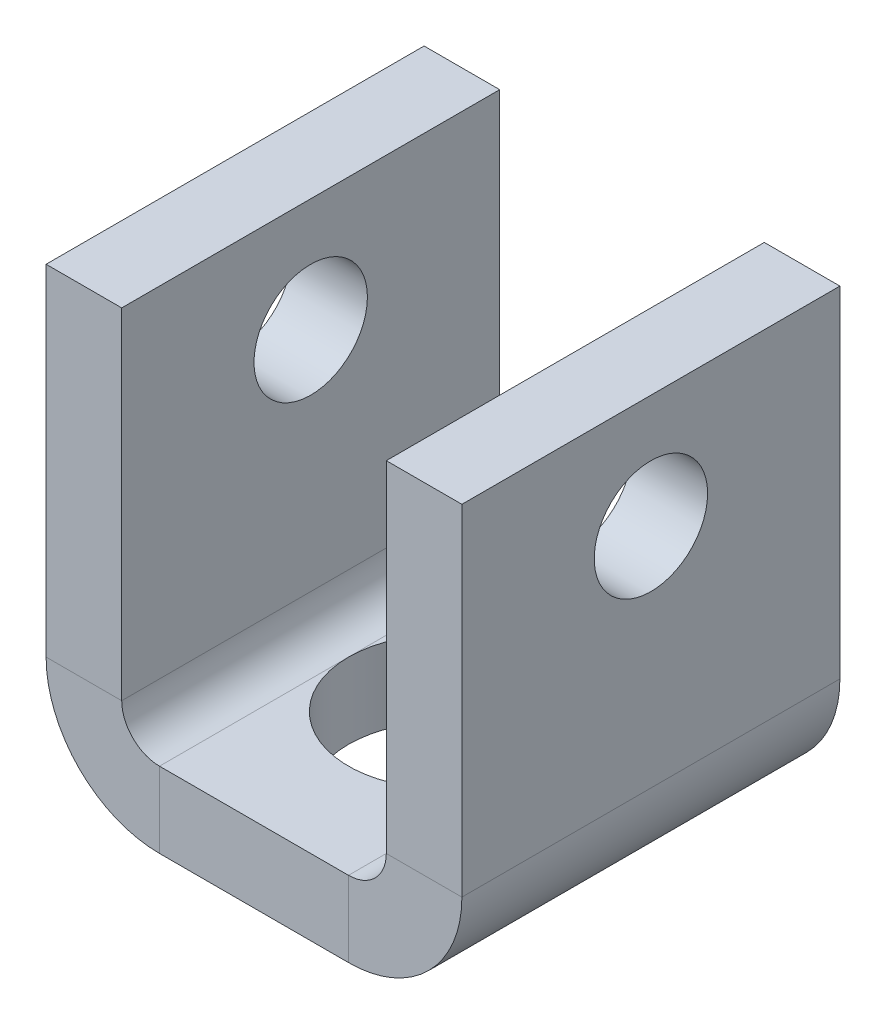
ISO-10303-21;
HEADER;
FILE_DESCRIPTION(('STEP AP214'),'2;1');
FILE_NAME('part.step','',(''),(''),'','','');
FILE_SCHEMA(('AUTOMOTIVE_DESIGN { 1 0 10303 214 1 1 1 1 }'));
ENDSEC;
DATA;
#1=APPLICATION_CONTEXT('core data for automotive mechanical design processes');
#2=APPLICATION_PROTOCOL_DEFINITION('international standard','automotive_design',2000,#1);
#3=PRODUCT_CONTEXT('',#1,'mechanical');
#4=PRODUCT('Part','Part','',(#3));
#5=PRODUCT_RELATED_PRODUCT_CATEGORY('part','',(#4));
#6=PRODUCT_DEFINITION_FORMATION('','',#4);
#7=PRODUCT_DEFINITION_CONTEXT('part definition',#1,'design');
#8=PRODUCT_DEFINITION('design','',#6,#7);
#9=PRODUCT_DEFINITION_SHAPE('','',#8);
#10=(LENGTH_UNIT() NAMED_UNIT(*) SI_UNIT(.MILLI.,.METRE.));
#11=(NAMED_UNIT(*) PLANE_ANGLE_UNIT() SI_UNIT($,.RADIAN.));
#12=(NAMED_UNIT(*) SI_UNIT($,.STERADIAN.) SOLID_ANGLE_UNIT());
#13=UNCERTAINTY_MEASURE_WITH_UNIT(LENGTH_MEASURE(1.E-05),#10,'distance_accuracy_value','');
#14=(GEOMETRIC_REPRESENTATION_CONTEXT(3) GLOBAL_UNCERTAINTY_ASSIGNED_CONTEXT((#13)) GLOBAL_UNIT_ASSIGNED_CONTEXT((#10,
#11,#12)) REPRESENTATION_CONTEXT('',''));
#15=CARTESIAN_POINT('',(0.,0.,0.));
#16=DIRECTION('',(0.,0.,1.));
#17=DIRECTION('',(1.,0.,0.));
#18=AXIS2_PLACEMENT_3D('',#15,#16,#17);
#19=CARTESIAN_POINT('',(-45.2821772639692,22.8679913294798,10.));
#20=DIRECTION('',(0.,1.,0.));
#21=DIRECTION('',(0.,0.,1.));
#22=AXIS2_PLACEMENT_3D('',#19,#20,#21);
#23=PLANE('',#22);
#24=DIRECTION('',(0.,0.,1.));
#25=VECTOR('',#24,1.);
#26=CARTESIAN_POINT('',(-42.2821772639692,22.8679913294798,0.));
#27=LINE('',#26,#25);
#28=CARTESIAN_POINT('',(-42.2821772639692,22.8679913294798,0.));
#29=VERTEX_POINT('',#28);
#30=CARTESIAN_POINT('',(-42.2821772639692,22.8679913294798,5.));
#31=VERTEX_POINT('',#30);
#32=EDGE_CURVE('E150',#29,#31,#27,.T.);
#33=ORIENTED_EDGE('',*,*,#32,.T.);
#34=CARTESIAN_POINT('',(-39.7821772639692,22.8679913294798,5.));
#35=DIRECTION('',(0.,1.,0.));
#36=DIRECTION('',(0.,0.,1.));
#37=AXIS2_PLACEMENT_3D('',#34,#35,#36);
#38=CIRCLE('',#37,2.5);
#39=CARTESIAN_POINT('',(-37.2821772639692,22.8679913294798,5.));
#40=VERTEX_POINT('',#39);
#41=EDGE_CURVE('E59',#31,#40,#38,.F.);
#42=ORIENTED_EDGE('',*,*,#41,.T.);
#43=DIRECTION('',(0.,0.,-1.));
#44=VECTOR('',#43,1.);
#45=CARTESIAN_POINT('',(-37.2821772639692,22.8679913294798,10.));
#46=LINE('',#45,#44);
#47=CARTESIAN_POINT('',(-37.2821772639692,22.8679913294798,0.));
#48=VERTEX_POINT('',#47);
#49=EDGE_CURVE('E147',#40,#48,#46,.T.);
#50=ORIENTED_EDGE('',*,*,#49,.T.);
#51=DIRECTION('',(1.,0.,0.));
#52=VECTOR('',#51,1.);
#53=CARTESIAN_POINT('',(-45.2821772639692,22.8679913294798,0.));
#54=LINE('',#53,#52);
#55=EDGE_CURVE('E302',#29,#48,#54,.T.);
#56=ORIENTED_EDGE('',*,*,#55,.F.);
#57=EDGE_LOOP('',(#33,#42,#50,#56));
#58=FACE_BOUND('',#57,.T.);
#59=ADVANCED_FACE('F36',(#58),#23,.T.);
#60=CARTESIAN_POINT('',(-37.2821772639692,22.8679913294798,10.));
#61=VERTEX_POINT('',#60);
#62=EDGE_CURVE('E159',#61,#40,#46,.T.);
#63=ORIENTED_EDGE('',*,*,#62,.T.);
#64=CARTESIAN_POINT('',(-39.7821772639692,22.8679913294798,5.));
#65=DIRECTION('',(0.,1.,0.));
#66=DIRECTION('',(0.,0.,1.));
#67=AXIS2_PLACEMENT_3D('',#64,#65,#66);
#68=CIRCLE('',#67,2.5);
#69=EDGE_CURVE('E136',#40,#31,#68,.F.);
#70=ORIENTED_EDGE('',*,*,#69,.T.);
#71=CARTESIAN_POINT('',(-42.2821772639692,22.8679913294798,10.));
#72=VERTEX_POINT('',#71);
#73=EDGE_CURVE('E305',#31,#72,#27,.T.);
#74=ORIENTED_EDGE('',*,*,#73,.T.);
#75=DIRECTION('',(1.,0.,0.));
#76=VECTOR('',#75,1.);
#77=CARTESIAN_POINT('',(-45.2821772639692,22.8679913294798,10.));
#78=LINE('',#77,#76);
#79=EDGE_CURVE('E169',#72,#61,#78,.T.);
#80=ORIENTED_EDGE('',*,*,#79,.T.);
#81=EDGE_LOOP('',(#63,#70,#74,#80));
#82=FACE_BOUND('',#81,.T.);
#83=ADVANCED_FACE('F167',(#82),#23,.T.);
#84=CARTESIAN_POINT('',(-45.2821772639692,20.8679913294798,10.));
#85=DIRECTION('',(0.,1.,0.));
#86=DIRECTION('',(0.,0.,1.));
#87=AXIS2_PLACEMENT_3D('',#84,#85,#86);
#88=PLANE('',#87);
#89=CARTESIAN_POINT('',(-39.7821772639692,20.8679913294798,5.));
#90=DIRECTION('',(0.,1.,0.));
#91=DIRECTION('',(0.,0.,1.));
#92=AXIS2_PLACEMENT_3D('',#89,#90,#91);
#93=CIRCLE('',#92,2.5);
#94=CARTESIAN_POINT('',(-42.2821772639692,20.8679913294798,5.));
#95=VERTEX_POINT('',#94);
#96=CARTESIAN_POINT('',(-37.2821772639692,20.8679913294798,5.));
#97=VERTEX_POINT('',#96);
#98=EDGE_CURVE('E52',#95,#97,#93,.F.);
#99=ORIENTED_EDGE('',*,*,#98,.F.);
#100=DIRECTION('',(0.,0.,1.));
#101=VECTOR('',#100,1.);
#102=CARTESIAN_POINT('',(-42.2821772639692,20.8679913294798,0.));
#103=LINE('',#102,#101);
#104=CARTESIAN_POINT('',(-42.2821772639692,20.8679913294798,0.));
#105=VERTEX_POINT('',#104);
#106=EDGE_CURVE('E300',#105,#95,#103,.T.);
#107=ORIENTED_EDGE('',*,*,#106,.F.);
#108=DIRECTION('',(1.,0.,0.));
#109=VECTOR('',#108,1.);
#110=CARTESIAN_POINT('',(-45.2821772639692,20.8679913294798,0.));
#111=LINE('',#110,#109);
#112=CARTESIAN_POINT('',(-37.2821772639692,20.8679913294798,0.));
#113=VERTEX_POINT('',#112);
#114=EDGE_CURVE('E290',#105,#113,#111,.T.);
#115=ORIENTED_EDGE('',*,*,#114,.T.);
#116=DIRECTION('',(0.,0.,-1.));
#117=VECTOR('',#116,1.);
#118=CARTESIAN_POINT('',(-37.2821772639692,20.8679913294798,10.));
#119=LINE('',#118,#117);
#120=EDGE_CURVE('E170',#97,#113,#119,.T.);
#121=ORIENTED_EDGE('',*,*,#120,.F.);
#122=EDGE_LOOP('',(#99,#107,#115,#121));
#123=FACE_BOUND('',#122,.T.);
#124=ADVANCED_FACE('F325',(#123),#88,.F.);
#125=EDGE_CURVE('E152',#97,#95,#93,.F.);
#126=ORIENTED_EDGE('',*,*,#125,.F.);
#127=CARTESIAN_POINT('',(-37.2821772639692,20.8679913294798,10.));
#128=VERTEX_POINT('',#127);
#129=EDGE_CURVE('E171',#128,#97,#119,.T.);
#130=ORIENTED_EDGE('',*,*,#129,.F.);
#131=DIRECTION('',(1.,0.,0.));
#132=VECTOR('',#131,1.);
#133=CARTESIAN_POINT('',(-45.2821772639692,20.8679913294798,10.));
#134=LINE('',#133,#132);
#135=CARTESIAN_POINT('',(-42.2821772639692,20.8679913294798,10.));
#136=VERTEX_POINT('',#135);
#137=EDGE_CURVE('E295',#136,#128,#134,.T.);
#138=ORIENTED_EDGE('',*,*,#137,.F.);
#139=EDGE_CURVE('E299',#95,#136,#103,.T.);
#140=ORIENTED_EDGE('',*,*,#139,.F.);
#141=EDGE_LOOP('',(#126,#130,#138,#140));
#142=FACE_BOUND('',#141,.T.);
#143=ADVANCED_FACE('F321',(#142),#88,.F.);
#144=CARTESIAN_POINT('',(-16.3749291698218,32.8679913294798,10.));
#145=DIRECTION('',(0.,1.,0.));
#146=DIRECTION('',(-1.,0.,0.));
#147=AXIS2_PLACEMENT_3D('',#144,#145,#146);
#148=PLANE('',#147);
#149=DIRECTION('',(0.,0.,-1.));
#150=VECTOR('',#149,1.);
#151=CARTESIAN_POINT('',(-45.2821772639692,32.8679913294798,10.));
#152=LINE('',#151,#150);
#153=CARTESIAN_POINT('',(-45.2821772639692,32.8679913294798,10.));
#154=VERTEX_POINT('',#153);
#155=CARTESIAN_POINT('',(-45.2821772639692,32.8679913294798,0.));
#156=VERTEX_POINT('',#155);
#157=EDGE_CURVE('E216',#154,#156,#152,.T.);
#158=ORIENTED_EDGE('',*,*,#157,.F.);
#159=DIRECTION('',(-1.,0.,0.));
#160=VECTOR('',#159,1.);
#161=CARTESIAN_POINT('',(-16.3749291698218,32.8679913294798,10.));
#162=LINE('',#161,#160);
#163=CARTESIAN_POINT('',(-43.2821772639692,32.8679913294798,10.));
#164=VERTEX_POINT('',#163);
#165=EDGE_CURVE('E213',#164,#154,#162,.T.);
#166=ORIENTED_EDGE('',*,*,#165,.F.);
#167=DIRECTION('',(0.,0.,-1.));
#168=VECTOR('',#167,1.);
#169=CARTESIAN_POINT('',(-43.2821772639692,32.8679913294798,10.));
#170=LINE('',#169,#168);
#171=CARTESIAN_POINT('',(-43.2821772639692,32.8679913294798,0.));
#172=VERTEX_POINT('',#171);
#173=EDGE_CURVE('E234',#164,#172,#170,.T.);
#174=ORIENTED_EDGE('',*,*,#173,.T.);
#175=DIRECTION('',(-1.,0.,0.));
#176=VECTOR('',#175,1.);
#177=CARTESIAN_POINT('',(-16.3749291698218,32.8679913294798,0.));
#178=LINE('',#177,#176);
#179=EDGE_CURVE('E231',#172,#156,#178,.T.);
#180=ORIENTED_EDGE('',*,*,#179,.T.);
#181=EDGE_LOOP('',(#158,#166,#174,#180));
#182=FACE_BOUND('',#181,.T.);
#183=ADVANCED_FACE('F263',(#182),#148,.T.);
#184=CARTESIAN_POINT('',(-16.3749291698218,32.8679913294798,0.));
#185=DIRECTION('',(0.,0.,-1.));
#186=DIRECTION('',(0.,1.,0.));
#187=AXIS2_PLACEMENT_3D('',#184,#185,#186);
#188=PLANE('',#187);
#189=DIRECTION('',(0.,-1.,0.));
#190=VECTOR('',#189,1.);
#191=CARTESIAN_POINT('',(-45.2821772639692,32.8679913294798,0.));
#192=LINE('',#191,#190);
#193=CARTESIAN_POINT('',(-45.2821772639692,23.8679913294798,0.));
#194=VERTEX_POINT('',#193);
#195=EDGE_CURVE('E221',#156,#194,#192,.T.);
#196=ORIENTED_EDGE('',*,*,#195,.F.);
#197=ORIENTED_EDGE('',*,*,#179,.F.);
#198=DIRECTION('',(0.,1.,0.));
#199=VECTOR('',#198,1.);
#200=CARTESIAN_POINT('',(-43.2821772639692,32.8679913294798,0.));
#201=LINE('',#200,#199);
#202=CARTESIAN_POINT('',(-43.2821772639692,23.8679913294798,0.));
#203=VERTEX_POINT('',#202);
#204=EDGE_CURVE('E228',#172,#203,#201,.F.);
#205=ORIENTED_EDGE('',*,*,#204,.T.);
#206=DIRECTION('',(-1.,0.,0.));
#207=VECTOR('',#206,1.);
#208=CARTESIAN_POINT('',(-16.3749291698218,23.8679913294798,0.));
#209=LINE('',#208,#207);
#210=EDGE_CURVE('E225',#203,#194,#209,.T.);
#211=ORIENTED_EDGE('',*,*,#210,.T.);
#212=EDGE_LOOP('',(#196,#197,#205,#211));
#213=FACE_BOUND('',#212,.T.);
#214=ADVANCED_FACE('F266',(#213),#188,.T.);
#215=CARTESIAN_POINT('',(-45.2821772639692,32.8679913294798,10.));
#216=DIRECTION('',(1.,0.,0.));
#217=DIRECTION('',(0.,0.,-1.));
#218=AXIS2_PLACEMENT_3D('',#215,#216,#217);
#219=PLANE('',#218);
#220=CARTESIAN_POINT('',(-45.2821772639692,29.8679913294798,5.));
#221=DIRECTION('',(1.,0.,0.));
#222=DIRECTION('',(0.,0.,-1.));
#223=AXIS2_PLACEMENT_3D('',#220,#221,#222);
#224=CIRCLE('',#223,1.5);
#225=CARTESIAN_POINT('',(-45.2821772639692,29.8679913294798,3.5));
#226=VERTEX_POINT('',#225);
#227=EDGE_CURVE('E386',#226,#226,#224,.F.);
#228=ORIENTED_EDGE('',*,*,#227,.F.);
#229=EDGE_LOOP('',(#228));
#230=FACE_BOUND('',#229,.T.);
#231=ORIENTED_EDGE('',*,*,#195,.T.);
#232=DIRECTION('',(0.,0.,1.));
#233=VECTOR('',#232,1.);
#234=CARTESIAN_POINT('',(-45.2821772639692,23.8679913294798,0.));
#235=LINE('',#234,#233);
#236=CARTESIAN_POINT('',(-45.2821772639692,23.8679913294798,10.));
#237=VERTEX_POINT('',#236);
#238=EDGE_CURVE('E218',#194,#237,#235,.T.);
#239=ORIENTED_EDGE('',*,*,#238,.T.);
#240=DIRECTION('',(0.,-1.,0.));
#241=VECTOR('',#240,1.);
#242=CARTESIAN_POINT('',(-45.2821772639692,32.8679913294798,10.));
#243=LINE('',#242,#241);
#244=EDGE_CURVE('E45',#154,#237,#243,.T.);
#245=ORIENTED_EDGE('',*,*,#244,.F.);
#246=ORIENTED_EDGE('',*,*,#157,.T.);
#247=EDGE_LOOP('',(#231,#239,#245,#246));
#248=FACE_BOUND('',#247,.T.);
#249=ADVANCED_FACE('F268',(#230,#248),#219,.F.);
#250=CARTESIAN_POINT('',(-16.3749291698218,32.8679913294798,10.));
#251=DIRECTION('',(0.,0.,-1.));
#252=DIRECTION('',(0.,1.,0.));
#253=AXIS2_PLACEMENT_3D('',#250,#251,#252);
#254=PLANE('',#253);
#255=ORIENTED_EDGE('',*,*,#165,.T.);
#256=ORIENTED_EDGE('',*,*,#244,.T.);
#257=DIRECTION('',(-1.,0.,0.));
#258=VECTOR('',#257,1.);
#259=CARTESIAN_POINT('',(-16.3749291698218,23.8679913294798,10.));
#260=LINE('',#259,#258);
#261=CARTESIAN_POINT('',(-43.2821772639692,23.8679913294798,10.));
#262=VERTEX_POINT('',#261);
#263=EDGE_CURVE('E236',#262,#237,#260,.T.);
#264=ORIENTED_EDGE('',*,*,#263,.F.);
#265=DIRECTION('',(0.,1.,0.));
#266=VECTOR('',#265,1.);
#267=CARTESIAN_POINT('',(-43.2821772639692,32.8679913294798,10.));
#268=LINE('',#267,#266);
#269=EDGE_CURVE('E11',#164,#262,#268,.F.);
#270=ORIENTED_EDGE('',*,*,#269,.F.);
#271=EDGE_LOOP('',(#255,#256,#264,#270));
#272=FACE_BOUND('',#271,.T.);
#273=ADVANCED_FACE('F257',(#272),#254,.F.);
#274=CARTESIAN_POINT('',(-43.2821772639692,32.8679913294798,10.));
#275=DIRECTION('',(1.,0.,0.));
#276=DIRECTION('',(0.,0.,-1.));
#277=AXIS2_PLACEMENT_3D('',#274,#275,#276);
#278=PLANE('',#277);
#279=CARTESIAN_POINT('',(-43.2821772639692,29.8679913294798,5.));
#280=DIRECTION('',(1.,0.,0.));
#281=DIRECTION('',(0.,0.,-1.));
#282=AXIS2_PLACEMENT_3D('',#279,#280,#281);
#283=CIRCLE('',#282,1.5);
#284=CARTESIAN_POINT('',(-43.2821772639692,29.8679913294798,3.5));
#285=VERTEX_POINT('',#284);
#286=EDGE_CURVE('E394',#285,#285,#283,.T.);
#287=ORIENTED_EDGE('',*,*,#286,.F.);
#288=EDGE_LOOP('',(#287));
#289=FACE_BOUND('',#288,.T.);
#290=DIRECTION('',(0.,0.,1.));
#291=VECTOR('',#290,1.);
#292=CARTESIAN_POINT('',(-43.2821772639692,23.8679913294798,0.));
#293=LINE('',#292,#291);
#294=EDGE_CURVE('E180',#203,#262,#293,.T.);
#295=ORIENTED_EDGE('',*,*,#294,.F.);
#296=ORIENTED_EDGE('',*,*,#204,.F.);
#297=ORIENTED_EDGE('',*,*,#173,.F.);
#298=ORIENTED_EDGE('',*,*,#269,.T.);
#299=EDGE_LOOP('',(#295,#296,#297,#298));
#300=FACE_BOUND('',#299,.T.);
#301=ADVANCED_FACE('F38',(#289,#300),#278,.T.);
#302=CARTESIAN_POINT('',(-63.1894253581166,32.8679913294798,10.));
#303=DIRECTION('',(0.,-1.,0.));
#304=DIRECTION('',(1.,0.,0.));
#305=AXIS2_PLACEMENT_3D('',#302,#303,#304);
#306=PLANE('',#305);
#307=DIRECTION('',(1.,0.,0.));
#308=VECTOR('',#307,1.);
#309=CARTESIAN_POINT('',(-63.1894253581166,32.8679913294798,10.));
#310=LINE('',#309,#308);
#311=CARTESIAN_POINT('',(-36.2821772639692,32.8679913294798,10.));
#312=VERTEX_POINT('',#311);
#313=CARTESIAN_POINT('',(-34.2821772639692,32.8679913294798,10.));
#314=VERTEX_POINT('',#313);
#315=EDGE_CURVE('E203',#312,#314,#310,.T.);
#316=ORIENTED_EDGE('',*,*,#315,.T.);
#317=DIRECTION('',(0.,0.,-1.));
#318=VECTOR('',#317,1.);
#319=CARTESIAN_POINT('',(-34.2821772639692,32.8679913294798,10.));
#320=LINE('',#319,#318);
#321=CARTESIAN_POINT('',(-34.2821772639692,32.8679913294798,0.));
#322=VERTEX_POINT('',#321);
#323=EDGE_CURVE('E199',#314,#322,#320,.T.);
#324=ORIENTED_EDGE('',*,*,#323,.T.);
#325=DIRECTION('',(1.,0.,0.));
#326=VECTOR('',#325,1.);
#327=CARTESIAN_POINT('',(-63.1894253581166,32.8679913294798,0.));
#328=LINE('',#327,#326);
#329=CARTESIAN_POINT('',(-36.2821772639692,32.8679913294798,0.));
#330=VERTEX_POINT('',#329);
#331=EDGE_CURVE('E183',#330,#322,#328,.T.);
#332=ORIENTED_EDGE('',*,*,#331,.F.);
#333=DIRECTION('',(0.,0.,-1.));
#334=VECTOR('',#333,1.);
#335=CARTESIAN_POINT('',(-36.2821772639692,32.8679913294798,10.));
#336=LINE('',#335,#334);
#337=EDGE_CURVE('E178',#312,#330,#336,.T.);
#338=ORIENTED_EDGE('',*,*,#337,.F.);
#339=EDGE_LOOP('',(#316,#324,#332,#338));
#340=FACE_BOUND('',#339,.T.);
#341=ADVANCED_FACE('F342',(#340),#306,.F.);
#342=CARTESIAN_POINT('',(-63.1894253581166,20.8679913294798,10.));
#343=DIRECTION('',(0.,0.,-1.));
#344=DIRECTION('',(0.,-1.,0.));
#345=AXIS2_PLACEMENT_3D('',#342,#343,#344);
#346=PLANE('',#345);
#347=DIRECTION('',(1.,0.,0.));
#348=VECTOR('',#347,1.);
#349=CARTESIAN_POINT('',(-63.1894253581166,23.8679913294798,10.));
#350=LINE('',#349,#348);
#351=CARTESIAN_POINT('',(-36.2821772639692,23.8679913294798,10.));
#352=VERTEX_POINT('',#351);
#353=CARTESIAN_POINT('',(-34.2821772639692,23.8679913294798,10.));
#354=VERTEX_POINT('',#353);
#355=EDGE_CURVE('E196',#352,#354,#350,.T.);
#356=ORIENTED_EDGE('',*,*,#355,.T.);
#357=DIRECTION('',(0.,1.,0.));
#358=VECTOR('',#357,1.);
#359=CARTESIAN_POINT('',(-34.2821772639692,20.8679913294798,10.));
#360=LINE('',#359,#358);
#361=EDGE_CURVE('E194',#354,#314,#360,.T.);
#362=ORIENTED_EDGE('',*,*,#361,.T.);
#363=ORIENTED_EDGE('',*,*,#315,.F.);
#364=DIRECTION('',(0.,1.,0.));
#365=VECTOR('',#364,1.);
#366=CARTESIAN_POINT('',(-36.2821772639692,20.8679913294798,10.));
#367=LINE('',#366,#365);
#368=EDGE_CURVE('E181',#352,#312,#367,.T.);
#369=ORIENTED_EDGE('',*,*,#368,.F.);
#370=EDGE_LOOP('',(#356,#362,#363,#369));
#371=FACE_BOUND('',#370,.T.);
#372=ADVANCED_FACE('F346',(#371),#346,.F.);
#373=CARTESIAN_POINT('',(-34.2821772639692,20.8679913294798,10.));
#374=DIRECTION('',(-1.,0.,0.));
#375=DIRECTION('',(0.,0.,1.));
#376=AXIS2_PLACEMENT_3D('',#373,#374,#375);
#377=PLANE('',#376);
#378=CARTESIAN_POINT('',(-34.2821772639692,29.8679913294798,5.));
#379=DIRECTION('',(1.,0.,0.));
#380=DIRECTION('',(0.,0.,-1.));
#381=AXIS2_PLACEMENT_3D('',#378,#379,#380);
#382=CIRCLE('',#381,1.5);
#383=CARTESIAN_POINT('',(-34.2821772639692,29.8679913294798,3.5));
#384=VERTEX_POINT('',#383);
#385=EDGE_CURVE('E383',#384,#384,#382,.T.);
#386=ORIENTED_EDGE('',*,*,#385,.F.);
#387=EDGE_LOOP('',(#386));
#388=FACE_BOUND('',#387,.T.);
#389=ORIENTED_EDGE('',*,*,#361,.F.);
#390=DIRECTION('',(0.,0.,-1.));
#391=VECTOR('',#390,1.);
#392=CARTESIAN_POINT('',(-34.2821772639692,23.8679913294798,10.));
#393=LINE('',#392,#391);
#394=CARTESIAN_POINT('',(-34.2821772639692,23.8679913294798,0.));
#395=VERTEX_POINT('',#394);
#396=EDGE_CURVE('E191',#354,#395,#393,.T.);
#397=ORIENTED_EDGE('',*,*,#396,.T.);
#398=DIRECTION('',(0.,1.,0.));
#399=VECTOR('',#398,1.);
#400=CARTESIAN_POINT('',(-34.2821772639692,20.8679913294798,0.));
#401=LINE('',#400,#399);
#402=EDGE_CURVE('E188',#395,#322,#401,.T.);
#403=ORIENTED_EDGE('',*,*,#402,.T.);
#404=ORIENTED_EDGE('',*,*,#323,.F.);
#405=EDGE_LOOP('',(#389,#397,#403,#404));
#406=FACE_BOUND('',#405,.T.);
#407=ADVANCED_FACE('F336',(#388,#406),#377,.F.);
#408=CARTESIAN_POINT('',(-63.1894253581166,20.8679913294798,0.));
#409=DIRECTION('',(0.,0.,-1.));
#410=DIRECTION('',(0.,-1.,0.));
#411=AXIS2_PLACEMENT_3D('',#408,#409,#410);
#412=PLANE('',#411);
#413=ORIENTED_EDGE('',*,*,#402,.F.);
#414=DIRECTION('',(1.,0.,0.));
#415=VECTOR('',#414,1.);
#416=CARTESIAN_POINT('',(-63.1894253581166,23.8679913294798,0.));
#417=LINE('',#416,#415);
#418=CARTESIAN_POINT('',(-36.2821772639692,23.8679913294798,0.));
#419=VERTEX_POINT('',#418);
#420=EDGE_CURVE('E207',#419,#395,#417,.T.);
#421=ORIENTED_EDGE('',*,*,#420,.F.);
#422=DIRECTION('',(0.,1.,0.));
#423=VECTOR('',#422,1.);
#424=CARTESIAN_POINT('',(-36.2821772639692,20.8679913294798,0.));
#425=LINE('',#424,#423);
#426=EDGE_CURVE('E185',#419,#330,#425,.T.);
#427=ORIENTED_EDGE('',*,*,#426,.T.);
#428=ORIENTED_EDGE('',*,*,#331,.T.);
#429=EDGE_LOOP('',(#413,#421,#427,#428));
#430=FACE_BOUND('',#429,.T.);
#431=ADVANCED_FACE('F338',(#430),#412,.T.);
#432=CARTESIAN_POINT('',(-36.2821772639692,20.8679913294798,10.));
#433=DIRECTION('',(-1.,0.,0.));
#434=DIRECTION('',(0.,0.,1.));
#435=AXIS2_PLACEMENT_3D('',#432,#433,#434);
#436=PLANE('',#435);
#437=CARTESIAN_POINT('',(-36.2821772639692,29.8679913294798,5.));
#438=DIRECTION('',(-1.,0.,0.));
#439=DIRECTION('',(0.,0.,1.));
#440=AXIS2_PLACEMENT_3D('',#437,#438,#439);
#441=CIRCLE('',#440,1.5);
#442=CARTESIAN_POINT('',(-36.2821772639692,29.8679913294798,6.5));
#443=VERTEX_POINT('',#442);
#444=EDGE_CURVE('E40',#443,#443,#441,.T.);
#445=ORIENTED_EDGE('',*,*,#444,.F.);
#446=EDGE_LOOP('',(#445));
#447=FACE_BOUND('',#446,.T.);
#448=DIRECTION('',(0.,0.,-1.));
#449=VECTOR('',#448,1.);
#450=CARTESIAN_POINT('',(-36.2821772639692,23.8679913294798,10.));
#451=LINE('',#450,#449);
#452=EDGE_CURVE('E177',#352,#419,#451,.T.);
#453=ORIENTED_EDGE('',*,*,#452,.F.);
#454=ORIENTED_EDGE('',*,*,#368,.T.);
#455=ORIENTED_EDGE('',*,*,#337,.T.);
#456=ORIENTED_EDGE('',*,*,#426,.F.);
#457=EDGE_LOOP('',(#453,#454,#455,#456));
#458=FACE_BOUND('',#457,.T.);
#459=ADVANCED_FACE('F349',(#447,#458),#436,.T.);
#460=CARTESIAN_POINT('',(-45.2821772639692,45.2286711044777,0.));
#461=DIRECTION('',(0.,0.,-1.));
#462=DIRECTION('',(-1.,0.,0.));
#463=AXIS2_PLACEMENT_3D('',#460,#461,#462);
#464=PLANE('',#463);
#465=ORIENTED_EDGE('',*,*,#114,.F.);
#466=DIRECTION('',(0.,-1.,0.));
#467=VECTOR('',#466,1.);
#468=CARTESIAN_POINT('',(-42.2821772639692,45.2286711044777,0.));
#469=LINE('',#468,#467);
#470=EDGE_CURVE('E164',#29,#105,#469,.T.);
#471=ORIENTED_EDGE('',*,*,#470,.F.);
#472=ORIENTED_EDGE('',*,*,#55,.T.);
#473=DIRECTION('',(0.,-1.,0.));
#474=VECTOR('',#473,1.);
#475=CARTESIAN_POINT('',(-37.2821772639692,45.2286711044777,0.));
#476=LINE('',#475,#474);
#477=EDGE_CURVE('E307',#48,#113,#476,.T.);
#478=ORIENTED_EDGE('',*,*,#477,.T.);
#479=EDGE_LOOP('',(#465,#471,#472,#478));
#480=FACE_BOUND('',#479,.T.);
#481=ADVANCED_FACE('F351',(#480),#464,.T.);
#482=CARTESIAN_POINT('',(-45.2821772639692,45.2286711044777,10.));
#483=DIRECTION('',(0.,0.,-1.));
#484=DIRECTION('',(-1.,0.,0.));
#485=AXIS2_PLACEMENT_3D('',#482,#483,#484);
#486=PLANE('',#485);
#487=DIRECTION('',(0.,-1.,0.));
#488=VECTOR('',#487,1.);
#489=CARTESIAN_POINT('',(-42.2821772639692,45.2286711044777,10.));
#490=LINE('',#489,#488);
#491=EDGE_CURVE('E253',#72,#136,#490,.T.);
#492=ORIENTED_EDGE('',*,*,#491,.T.);
#493=ORIENTED_EDGE('',*,*,#137,.T.);
#494=DIRECTION('',(0.,-1.,0.));
#495=VECTOR('',#494,1.);
#496=CARTESIAN_POINT('',(-37.2821772639692,45.2286711044777,10.));
#497=LINE('',#496,#495);
#498=EDGE_CURVE('E310',#61,#128,#497,.T.);
#499=ORIENTED_EDGE('',*,*,#498,.F.);
#500=ORIENTED_EDGE('',*,*,#79,.F.);
#501=EDGE_LOOP('',(#492,#493,#499,#500));
#502=FACE_BOUND('',#501,.T.);
#503=ADVANCED_FACE('F312',(#502),#486,.F.);
#504=CARTESIAN_POINT('',(-37.2821772639692,23.8679913294798,0.));
#505=DIRECTION('',(0.,0.,-1.));
#506=DIRECTION('',(-1.,0.,0.));
#507=AXIS2_PLACEMENT_3D('',#504,#505,#506);
#508=PLANE('',#507);
#509=ORIENTED_EDGE('',*,*,#477,.F.);
#510=CARTESIAN_POINT('',(-37.2821772639692,23.8679913294798,0.));
#511=DIRECTION('',(0.,0.,-1.));
#512=DIRECTION('',(-1.,0.,0.));
#513=AXIS2_PLACEMENT_3D('',#510,#511,#512);
#514=CIRCLE('',#513,0.999999999999998);
#515=EDGE_CURVE('E162',#48,#419,#514,.F.);
#516=ORIENTED_EDGE('',*,*,#515,.T.);
#517=ORIENTED_EDGE('',*,*,#420,.T.);
#518=CARTESIAN_POINT('',(-37.2821772639692,23.8679913294798,0.));
#519=DIRECTION('',(0.,0.,-1.));
#520=DIRECTION('',(-1.,0.,0.));
#521=AXIS2_PLACEMENT_3D('',#518,#519,#520);
#522=CIRCLE('',#521,3.);
#523=EDGE_CURVE('E288',#113,#395,#522,.F.);
#524=ORIENTED_EDGE('',*,*,#523,.F.);
#525=EDGE_LOOP('',(#509,#516,#517,#524));
#526=FACE_BOUND('',#525,.T.);
#527=ADVANCED_FACE('F329',(#526),#508,.T.);
#528=CARTESIAN_POINT('',(-37.2821772639692,23.8679913294798,10.));
#529=DIRECTION('',(0.,0.,1.));
#530=DIRECTION('',(1.,0.,0.));
#531=AXIS2_PLACEMENT_3D('',#528,#529,#530);
#532=PLANE('',#531);
#533=ORIENTED_EDGE('',*,*,#355,.F.);
#534=CARTESIAN_POINT('',(-37.2821772639692,23.8679913294798,10.));
#535=DIRECTION('',(0.,0.,-1.));
#536=DIRECTION('',(-1.,0.,0.));
#537=AXIS2_PLACEMENT_3D('',#534,#535,#536);
#538=CIRCLE('',#537,0.999999999999998);
#539=EDGE_CURVE('E280',#352,#61,#538,.T.);
#540=ORIENTED_EDGE('',*,*,#539,.T.);
#541=ORIENTED_EDGE('',*,*,#498,.T.);
#542=CARTESIAN_POINT('',(-37.2821772639692,23.8679913294798,10.));
#543=DIRECTION('',(0.,0.,-1.));
#544=DIRECTION('',(-1.,0.,0.));
#545=AXIS2_PLACEMENT_3D('',#542,#543,#544);
#546=CIRCLE('',#545,3.);
#547=EDGE_CURVE('E285',#354,#128,#546,.T.);
#548=ORIENTED_EDGE('',*,*,#547,.F.);
#549=EDGE_LOOP('',(#533,#540,#541,#548));
#550=FACE_BOUND('',#549,.T.);
#551=ADVANCED_FACE('F316',(#550),#532,.T.);
#552=CARTESIAN_POINT('',(-37.2821772639692,23.8679913294798,41.0081431519951));
#553=DIRECTION('',(0.,0.,-1.));
#554=DIRECTION('',(-1.,0.,0.));
#555=AXIS2_PLACEMENT_3D('',#552,#553,#554);
#556=CYLINDRICAL_SURFACE('',#555,3.);
#557=ORIENTED_EDGE('',*,*,#547,.T.);
#558=ORIENTED_EDGE('',*,*,#129,.T.);
#559=ORIENTED_EDGE('',*,*,#120,.T.);
#560=ORIENTED_EDGE('',*,*,#523,.T.);
#561=ORIENTED_EDGE('',*,*,#396,.F.);
#562=EDGE_LOOP('',(#557,#558,#559,#560,#561));
#563=FACE_BOUND('',#562,.T.);
#564=ADVANCED_FACE('F319',(#563),#556,.T.);
#565=CARTESIAN_POINT('',(-37.2821772639692,23.8679913294798,41.0081431519951));
#566=DIRECTION('',(0.,0.,-1.));
#567=DIRECTION('',(-1.,0.,0.));
#568=AXIS2_PLACEMENT_3D('',#565,#566,#567);
#569=CYLINDRICAL_SURFACE('',#568,0.999999999999998);
#570=ORIENTED_EDGE('',*,*,#539,.F.);
#571=ORIENTED_EDGE('',*,*,#452,.T.);
#572=ORIENTED_EDGE('',*,*,#515,.F.);
#573=ORIENTED_EDGE('',*,*,#49,.F.);
#574=ORIENTED_EDGE('',*,*,#62,.F.);
#575=EDGE_LOOP('',(#570,#571,#572,#573,#574));
#576=FACE_BOUND('',#575,.T.);
#577=ADVANCED_FACE('F158',(#576),#569,.F.);
#578=CARTESIAN_POINT('',(-42.2821772639692,23.8679913294798,10.));
#579=DIRECTION('',(0.,0.,1.));
#580=DIRECTION('',(1.,0.,0.));
#581=AXIS2_PLACEMENT_3D('',#578,#579,#580);
#582=PLANE('',#581);
#583=ORIENTED_EDGE('',*,*,#491,.F.);
#584=CARTESIAN_POINT('',(-42.2821772639692,23.8679913294798,10.));
#585=DIRECTION('',(0.,0.,1.));
#586=DIRECTION('',(1.,0.,0.));
#587=AXIS2_PLACEMENT_3D('',#584,#585,#586);
#588=CIRCLE('',#587,1.);
#589=EDGE_CURVE('E244',#72,#262,#588,.F.);
#590=ORIENTED_EDGE('',*,*,#589,.T.);
#591=ORIENTED_EDGE('',*,*,#263,.T.);
#592=CARTESIAN_POINT('',(-42.2821772639692,23.8679913294798,10.));
#593=DIRECTION('',(0.,0.,1.));
#594=DIRECTION('',(1.,0.,0.));
#595=AXIS2_PLACEMENT_3D('',#592,#593,#594);
#596=CIRCLE('',#595,3.);
#597=EDGE_CURVE('E275',#136,#237,#596,.F.);
#598=ORIENTED_EDGE('',*,*,#597,.F.);
#599=EDGE_LOOP('',(#583,#590,#591,#598));
#600=FACE_BOUND('',#599,.T.);
#601=ADVANCED_FACE('F250',(#600),#582,.T.);
#602=CARTESIAN_POINT('',(-42.2821772639692,23.8679913294798,0.));
#603=DIRECTION('',(0.,0.,-1.));
#604=DIRECTION('',(-1.,0.,0.));
#605=AXIS2_PLACEMENT_3D('',#602,#603,#604);
#606=PLANE('',#605);
#607=ORIENTED_EDGE('',*,*,#210,.F.);
#608=CARTESIAN_POINT('',(-42.2821772639692,23.8679913294798,0.));
#609=DIRECTION('',(0.,0.,1.));
#610=DIRECTION('',(1.,0.,0.));
#611=AXIS2_PLACEMENT_3D('',#608,#609,#610);
#612=CIRCLE('',#611,1.);
#613=EDGE_CURVE('E141',#203,#29,#612,.T.);
#614=ORIENTED_EDGE('',*,*,#613,.T.);
#615=ORIENTED_EDGE('',*,*,#470,.T.);
#616=CARTESIAN_POINT('',(-42.2821772639692,23.8679913294798,0.));
#617=DIRECTION('',(0.,0.,1.));
#618=DIRECTION('',(1.,0.,0.));
#619=AXIS2_PLACEMENT_3D('',#616,#617,#618);
#620=CIRCLE('',#619,3.);
#621=EDGE_CURVE('E254',#194,#105,#620,.T.);
#622=ORIENTED_EDGE('',*,*,#621,.F.);
#623=EDGE_LOOP('',(#607,#614,#615,#622));
#624=FACE_BOUND('',#623,.T.);
#625=ADVANCED_FACE('F277',(#624),#606,.T.);
#626=CARTESIAN_POINT('',(-42.2821772639692,23.8679913294798,-25.488894731297));
#627=DIRECTION('',(0.,0.,1.));
#628=DIRECTION('',(1.,0.,0.));
#629=AXIS2_PLACEMENT_3D('',#626,#627,#628);
#630=CYLINDRICAL_SURFACE('',#629,3.);
#631=ORIENTED_EDGE('',*,*,#621,.T.);
#632=ORIENTED_EDGE('',*,*,#106,.T.);
#633=ORIENTED_EDGE('',*,*,#139,.T.);
#634=ORIENTED_EDGE('',*,*,#597,.T.);
#635=ORIENTED_EDGE('',*,*,#238,.F.);
#636=EDGE_LOOP('',(#631,#632,#633,#634,#635));
#637=FACE_BOUND('',#636,.T.);
#638=ADVANCED_FACE('F272',(#637),#630,.T.);
#639=CARTESIAN_POINT('',(-42.2821772639692,23.8679913294798,-25.488894731297));
#640=DIRECTION('',(0.,0.,1.));
#641=DIRECTION('',(1.,0.,0.));
#642=AXIS2_PLACEMENT_3D('',#639,#640,#641);
#643=CYLINDRICAL_SURFACE('',#642,1.);
#644=ORIENTED_EDGE('',*,*,#613,.F.);
#645=ORIENTED_EDGE('',*,*,#294,.T.);
#646=ORIENTED_EDGE('',*,*,#589,.F.);
#647=ORIENTED_EDGE('',*,*,#73,.F.);
#648=ORIENTED_EDGE('',*,*,#32,.F.);
#649=EDGE_LOOP('',(#644,#645,#646,#647,#648));
#650=FACE_BOUND('',#649,.T.);
#651=ADVANCED_FACE('F243',(#650),#643,.F.);
#652=CARTESIAN_POINT('',(-39.7821772639692,20.8679913294798,5.));
#653=DIRECTION('',(0.,1.,0.));
#654=DIRECTION('',(0.,0.,1.));
#655=AXIS2_PLACEMENT_3D('',#652,#653,#654);
#656=CYLINDRICAL_SURFACE('',#655,2.5);
#657=ORIENTED_EDGE('',*,*,#69,.F.);
#658=ORIENTED_EDGE('',*,*,#41,.F.);
#659=EDGE_LOOP('',(#657,#658));
#660=FACE_BOUND('',#659,.T.);
#661=ORIENTED_EDGE('',*,*,#98,.T.);
#662=ORIENTED_EDGE('',*,*,#125,.T.);
#663=EDGE_LOOP('',(#661,#662));
#664=FACE_BOUND('',#663,.T.);
#665=ADVANCED_FACE('F137',(#660,#664),#656,.F.);
#666=CARTESIAN_POINT('',(-49.5248179510885,29.8679913294798,5.));
#667=DIRECTION('',(1.,0.,0.));
#668=DIRECTION('',(0.,0.,-1.));
#669=AXIS2_PLACEMENT_3D('',#666,#667,#668);
#670=CYLINDRICAL_SURFACE('',#669,1.5);
#671=ORIENTED_EDGE('',*,*,#444,.T.);
#672=EDGE_LOOP('',(#671));
#673=FACE_BOUND('',#672,.T.);
#674=ORIENTED_EDGE('',*,*,#385,.T.);
#675=EDGE_LOOP('',(#674));
#676=FACE_BOUND('',#675,.T.);
#677=ADVANCED_FACE('F402',(#673,#676),#670,.F.);
#678=ORIENTED_EDGE('',*,*,#286,.T.);
#679=EDGE_LOOP('',(#678));
#680=FACE_BOUND('',#679,.T.);
#681=ORIENTED_EDGE('',*,*,#227,.T.);
#682=EDGE_LOOP('',(#681));
#683=FACE_BOUND('',#682,.T.);
#684=ADVANCED_FACE('F404',(#680,#683),#670,.F.);
#685=CLOSED_SHELL('',(#59,#83,#124,#143,#183,#214,#249,#273,#301,#341,#372,#407,#431,#459,#481,
#503,#527,#551,#564,#577,#601,#625,#638,#651,#665,#677,#684));
#686=MANIFOLD_SOLID_BREP('B2',#685);
#687=ADVANCED_BREP_SHAPE_REPRESENTATION('',(#18,#686),#14);
#688=SHAPE_DEFINITION_REPRESENTATION(#9,#687);
ENDSEC;
END-ISO-10303-21;
